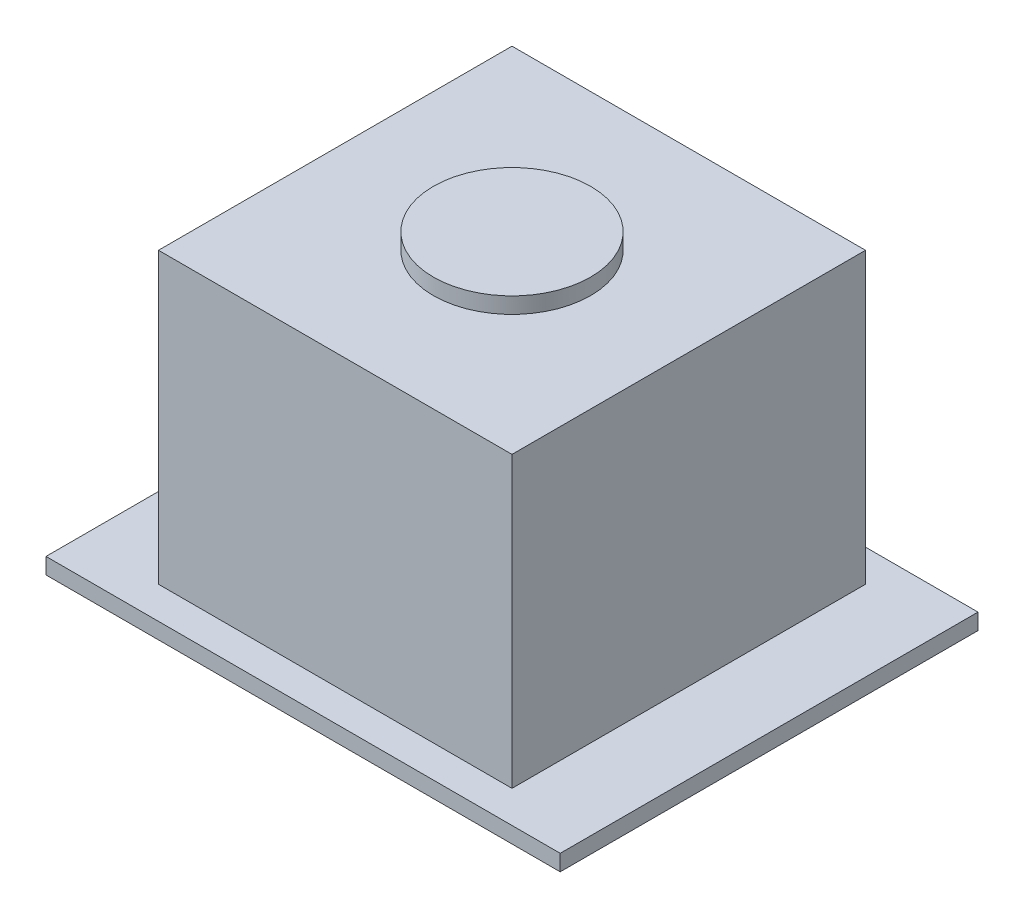
ISO-10303-21;
HEADER;
FILE_DESCRIPTION(('STEP AP214'),'2;1');
FILE_NAME('part.step','',(''),(''),'','','');
FILE_SCHEMA(('AUTOMOTIVE_DESIGN { 1 0 10303 214 1 1 1 1 }'));
ENDSEC;
DATA;
#1=APPLICATION_CONTEXT('core data for automotive mechanical design processes');
#2=APPLICATION_PROTOCOL_DEFINITION('international standard','automotive_design',2000,#1);
#3=PRODUCT_CONTEXT('',#1,'mechanical');
#4=PRODUCT('Part','Part','',(#3));
#5=PRODUCT_RELATED_PRODUCT_CATEGORY('part','',(#4));
#6=PRODUCT_DEFINITION_FORMATION('','',#4);
#7=PRODUCT_DEFINITION_CONTEXT('part definition',#1,'design');
#8=PRODUCT_DEFINITION('design','',#6,#7);
#9=PRODUCT_DEFINITION_SHAPE('','',#8);
#10=(LENGTH_UNIT() NAMED_UNIT(*) SI_UNIT(.MILLI.,.METRE.));
#11=(NAMED_UNIT(*) PLANE_ANGLE_UNIT() SI_UNIT($,.RADIAN.));
#12=(NAMED_UNIT(*) SI_UNIT($,.STERADIAN.) SOLID_ANGLE_UNIT());
#13=UNCERTAINTY_MEASURE_WITH_UNIT(LENGTH_MEASURE(1.E-05),#10,'distance_accuracy_value','');
#14=(GEOMETRIC_REPRESENTATION_CONTEXT(3) GLOBAL_UNCERTAINTY_ASSIGNED_CONTEXT((#13)) GLOBAL_UNIT_ASSIGNED_CONTEXT((#10,
#11,#12)) REPRESENTATION_CONTEXT('',''));
#15=CARTESIAN_POINT('',(0.,0.,0.));
#16=DIRECTION('',(0.,0.,1.));
#17=DIRECTION('',(1.,0.,0.));
#18=AXIS2_PLACEMENT_3D('',#15,#16,#17);
#19=CARTESIAN_POINT('',(132.976530612245,9.,96.6260204081633));
#20=DIRECTION('',(1.,0.,0.));
#21=DIRECTION('',(0.,0.,-1.));
#22=AXIS2_PLACEMENT_3D('',#19,#20,#21);
#23=PLANE('',#22);
#24=DIRECTION('',(0.,0.,1.));
#25=VECTOR('',#24,1.);
#26=CARTESIAN_POINT('',(132.976530612245,0.,96.6260204081633));
#27=LINE('',#26,#25);
#28=CARTESIAN_POINT('',(132.976530612245,0.,96.6260204081633));
#29=VERTEX_POINT('',#28);
#30=CARTESIAN_POINT('',(132.976530612245,0.,107.626020408163));
#31=VERTEX_POINT('',#30);
#32=EDGE_CURVE('E135',#29,#31,#27,.T.);
#33=ORIENTED_EDGE('',*,*,#32,.T.);
#34=DIRECTION('',(0.,-1.,0.));
#35=VECTOR('',#34,1.);
#36=CARTESIAN_POINT('',(132.976530612245,9.,107.626020408163));
#37=LINE('',#36,#35);
#38=CARTESIAN_POINT('',(132.976530612245,9.,107.626020408163));
#39=VERTEX_POINT('',#38);
#40=EDGE_CURVE('E48',#39,#31,#37,.T.);
#41=ORIENTED_EDGE('',*,*,#40,.F.);
#42=DIRECTION('',(0.,0.,1.));
#43=VECTOR('',#42,1.);
#44=CARTESIAN_POINT('',(132.976530612245,9.,96.6260204081633));
#45=LINE('',#44,#43);
#46=CARTESIAN_POINT('',(132.976530612245,9.,96.6260204081633));
#47=VERTEX_POINT('',#46);
#48=EDGE_CURVE('E146',#47,#39,#45,.T.);
#49=ORIENTED_EDGE('',*,*,#48,.F.);
#50=DIRECTION('',(0.,-1.,0.));
#51=VECTOR('',#50,1.);
#52=CARTESIAN_POINT('',(132.976530612245,9.,96.6260204081633));
#53=LINE('',#52,#51);
#54=EDGE_CURVE('E157',#47,#29,#53,.T.);
#55=ORIENTED_EDGE('',*,*,#54,.T.);
#56=EDGE_LOOP('',(#33,#41,#49,#55));
#57=FACE_BOUND('',#56,.T.);
#58=ADVANCED_FACE('F45',(#57),#23,.F.);
#59=CARTESIAN_POINT('',(132.976530612245,9.,107.626020408163));
#60=DIRECTION('',(0.,0.,-1.));
#61=DIRECTION('',(-1.,0.,0.));
#62=AXIS2_PLACEMENT_3D('',#59,#60,#61);
#63=PLANE('',#62);
#64=DIRECTION('',(1.,0.,0.));
#65=VECTOR('',#64,1.);
#66=CARTESIAN_POINT('',(132.976530612245,0.,107.626020408163));
#67=LINE('',#66,#65);
#68=CARTESIAN_POINT('',(143.976530612245,0.,107.626020408163));
#69=VERTEX_POINT('',#68);
#70=EDGE_CURVE('E140',#31,#69,#67,.T.);
#71=ORIENTED_EDGE('',*,*,#70,.T.);
#72=DIRECTION('',(0.,-1.,0.));
#73=VECTOR('',#72,1.);
#74=CARTESIAN_POINT('',(143.976530612245,9.,107.626020408163));
#75=LINE('',#74,#73);
#76=CARTESIAN_POINT('',(143.976530612245,9.,107.626020408163));
#77=VERTEX_POINT('',#76);
#78=EDGE_CURVE('E175',#77,#69,#75,.T.);
#79=ORIENTED_EDGE('',*,*,#78,.F.);
#80=DIRECTION('',(1.,0.,0.));
#81=VECTOR('',#80,1.);
#82=CARTESIAN_POINT('',(132.976530612245,9.,107.626020408163));
#83=LINE('',#82,#81);
#84=EDGE_CURVE('E149',#39,#77,#83,.T.);
#85=ORIENTED_EDGE('',*,*,#84,.F.);
#86=ORIENTED_EDGE('',*,*,#40,.T.);
#87=EDGE_LOOP('',(#71,#79,#85,#86));
#88=FACE_BOUND('',#87,.T.);
#89=ADVANCED_FACE('F185',(#88),#63,.F.);
#90=CARTESIAN_POINT('',(143.976530612245,9.,96.6260204081633));
#91=DIRECTION('',(-1.,0.,0.));
#92=DIRECTION('',(0.,0.,1.));
#93=AXIS2_PLACEMENT_3D('',#90,#91,#92);
#94=PLANE('',#93);
#95=DIRECTION('',(0.,0.,-1.));
#96=VECTOR('',#95,1.);
#97=CARTESIAN_POINT('',(143.976530612245,0.,96.6260204081633));
#98=LINE('',#97,#96);
#99=CARTESIAN_POINT('',(143.976530612245,0.,96.6260204081633));
#100=VERTEX_POINT('',#99);
#101=EDGE_CURVE('E162',#69,#100,#98,.T.);
#102=ORIENTED_EDGE('',*,*,#101,.T.);
#103=DIRECTION('',(0.,-1.,0.));
#104=VECTOR('',#103,1.);
#105=CARTESIAN_POINT('',(143.976530612245,9.,96.6260204081633));
#106=LINE('',#105,#104);
#107=CARTESIAN_POINT('',(143.976530612245,9.,96.6260204081633));
#108=VERTEX_POINT('',#107);
#109=EDGE_CURVE('E172',#108,#100,#106,.T.);
#110=ORIENTED_EDGE('',*,*,#109,.F.);
#111=DIRECTION('',(0.,0.,-1.));
#112=VECTOR('',#111,1.);
#113=CARTESIAN_POINT('',(143.976530612245,9.,96.6260204081633));
#114=LINE('',#113,#112);
#115=EDGE_CURVE('E153',#77,#108,#114,.T.);
#116=ORIENTED_EDGE('',*,*,#115,.F.);
#117=ORIENTED_EDGE('',*,*,#78,.T.);
#118=EDGE_LOOP('',(#102,#110,#116,#117));
#119=FACE_BOUND('',#118,.T.);
#120=ADVANCED_FACE('F195',(#119),#94,.F.);
#121=CARTESIAN_POINT('',(132.976530612245,9.,96.6260204081633));
#122=DIRECTION('',(0.,0.,1.));
#123=DIRECTION('',(1.,0.,0.));
#124=AXIS2_PLACEMENT_3D('',#121,#122,#123);
#125=PLANE('',#124);
#126=DIRECTION('',(-1.,0.,0.));
#127=VECTOR('',#126,1.);
#128=CARTESIAN_POINT('',(132.976530612245,0.,96.6260204081633));
#129=LINE('',#128,#127);
#130=EDGE_CURVE('E150',#100,#29,#129,.T.);
#131=ORIENTED_EDGE('',*,*,#130,.T.);
#132=ORIENTED_EDGE('',*,*,#54,.F.);
#133=DIRECTION('',(-1.,0.,0.));
#134=VECTOR('',#133,1.);
#135=CARTESIAN_POINT('',(132.976530612245,9.,96.6260204081633));
#136=LINE('',#135,#134);
#137=EDGE_CURVE('E62',#108,#47,#136,.T.);
#138=ORIENTED_EDGE('',*,*,#137,.F.);
#139=ORIENTED_EDGE('',*,*,#109,.T.);
#140=EDGE_LOOP('',(#131,#132,#138,#139));
#141=FACE_BOUND('',#140,.T.);
#142=ADVANCED_FACE('F193',(#141),#125,.F.);
#143=CARTESIAN_POINT('',(0.,9.,0.));
#144=DIRECTION('',(0.,1.,0.));
#145=DIRECTION('',(0.,0.,1.));
#146=AXIS2_PLACEMENT_3D('',#143,#144,#145);
#147=PLANE('',#146);
#148=CARTESIAN_POINT('',(138.476530612245,9.,102.126020408163));
#149=DIRECTION('',(0.,1.,0.));
#150=DIRECTION('',(0.,0.,1.));
#151=AXIS2_PLACEMENT_3D('',#148,#149,#150);
#152=CIRCLE('',#151,2.44658702742082);
#153=CARTESIAN_POINT('',(138.476530612245,9.,104.572607435584));
#154=VERTEX_POINT('',#153);
#155=EDGE_CURVE('E11',#154,#154,#152,.T.);
#156=ORIENTED_EDGE('',*,*,#155,.F.);
#157=EDGE_LOOP('',(#156));
#158=FACE_BOUND('',#157,.T.);
#159=ORIENTED_EDGE('',*,*,#48,.T.);
#160=ORIENTED_EDGE('',*,*,#84,.T.);
#161=ORIENTED_EDGE('',*,*,#115,.T.);
#162=ORIENTED_EDGE('',*,*,#137,.T.);
#163=EDGE_LOOP('',(#159,#160,#161,#162));
#164=FACE_BOUND('',#163,.T.);
#165=ADVANCED_FACE('F196',(#158,#164),#147,.T.);
#166=CARTESIAN_POINT('',(130.476530612245,-0.5,108.626020408163));
#167=DIRECTION('',(1.,0.,0.));
#168=DIRECTION('',(0.,0.,-1.));
#169=AXIS2_PLACEMENT_3D('',#166,#167,#168);
#170=PLANE('',#169);
#171=DIRECTION('',(0.,0.,-1.));
#172=VECTOR('',#171,1.);
#173=CARTESIAN_POINT('',(130.476530612245,0.,108.626020408163));
#174=LINE('',#173,#172);
#175=CARTESIAN_POINT('',(130.476530612245,0.,108.626020408163));
#176=VERTEX_POINT('',#175);
#177=CARTESIAN_POINT('',(130.476530612245,0.,95.6260204081633));
#178=VERTEX_POINT('',#177);
#179=EDGE_CURVE('E133',#176,#178,#174,.T.);
#180=ORIENTED_EDGE('',*,*,#179,.T.);
#181=DIRECTION('',(0.,1.,0.));
#182=VECTOR('',#181,1.);
#183=CARTESIAN_POINT('',(130.476530612245,-0.5,95.6260204081633));
#184=LINE('',#183,#182);
#185=CARTESIAN_POINT('',(130.476530612245,-0.5,95.6260204081633));
#186=VERTEX_POINT('',#185);
#187=EDGE_CURVE('E111',#186,#178,#184,.T.);
#188=ORIENTED_EDGE('',*,*,#187,.F.);
#189=DIRECTION('',(0.,0.,-1.));
#190=VECTOR('',#189,1.);
#191=CARTESIAN_POINT('',(130.476530612245,-0.5,108.626020408163));
#192=LINE('',#191,#190);
#193=CARTESIAN_POINT('',(130.476530612245,-0.5,108.626020408163));
#194=VERTEX_POINT('',#193);
#195=EDGE_CURVE('E119',#194,#186,#192,.T.);
#196=ORIENTED_EDGE('',*,*,#195,.F.);
#197=DIRECTION('',(0.,1.,0.));
#198=VECTOR('',#197,1.);
#199=CARTESIAN_POINT('',(130.476530612245,-0.5,108.626020408163));
#200=LINE('',#199,#198);
#201=EDGE_CURVE('E302',#194,#176,#200,.T.);
#202=ORIENTED_EDGE('',*,*,#201,.T.);
#203=EDGE_LOOP('',(#180,#188,#196,#202));
#204=FACE_BOUND('',#203,.T.);
#205=ADVANCED_FACE('F131',(#204),#170,.F.);
#206=CARTESIAN_POINT('',(130.476530612245,-0.5,95.6260204081633));
#207=DIRECTION('',(0.,0.,1.));
#208=DIRECTION('',(1.,0.,0.));
#209=AXIS2_PLACEMENT_3D('',#206,#207,#208);
#210=PLANE('',#209);
#211=DIRECTION('',(1.,0.,0.));
#212=VECTOR('',#211,1.);
#213=CARTESIAN_POINT('',(130.476530612245,0.,95.6260204081633));
#214=LINE('',#213,#212);
#215=CARTESIAN_POINT('',(146.476530612245,0.,95.6260204081633));
#216=VERTEX_POINT('',#215);
#217=EDGE_CURVE('E296',#178,#216,#214,.T.);
#218=ORIENTED_EDGE('',*,*,#217,.T.);
#219=DIRECTION('',(0.,1.,0.));
#220=VECTOR('',#219,1.);
#221=CARTESIAN_POINT('',(146.476530612245,-0.5,95.6260204081633));
#222=LINE('',#221,#220);
#223=CARTESIAN_POINT('',(146.476530612245,-0.5,95.6260204081633));
#224=VERTEX_POINT('',#223);
#225=EDGE_CURVE('E114',#224,#216,#222,.T.);
#226=ORIENTED_EDGE('',*,*,#225,.F.);
#227=DIRECTION('',(1.,0.,0.));
#228=VECTOR('',#227,1.);
#229=CARTESIAN_POINT('',(130.476530612245,-0.5,95.6260204081633));
#230=LINE('',#229,#228);
#231=EDGE_CURVE('E107',#186,#224,#230,.T.);
#232=ORIENTED_EDGE('',*,*,#231,.F.);
#233=ORIENTED_EDGE('',*,*,#187,.T.);
#234=EDGE_LOOP('',(#218,#226,#232,#233));
#235=FACE_BOUND('',#234,.T.);
#236=ADVANCED_FACE('F109',(#235),#210,.F.);
#237=CARTESIAN_POINT('',(146.476530612245,-0.5,108.626020408163));
#238=DIRECTION('',(-1.,0.,0.));
#239=DIRECTION('',(0.,0.,1.));
#240=AXIS2_PLACEMENT_3D('',#237,#238,#239);
#241=PLANE('',#240);
#242=DIRECTION('',(0.,0.,1.));
#243=VECTOR('',#242,1.);
#244=CARTESIAN_POINT('',(146.476530612245,0.,108.626020408163));
#245=LINE('',#244,#243);
#246=CARTESIAN_POINT('',(146.476530612245,0.,108.626020408163));
#247=VERTEX_POINT('',#246);
#248=EDGE_CURVE('E306',#216,#247,#245,.T.);
#249=ORIENTED_EDGE('',*,*,#248,.T.);
#250=DIRECTION('',(0.,1.,0.));
#251=VECTOR('',#250,1.);
#252=CARTESIAN_POINT('',(146.476530612245,-0.5,108.626020408163));
#253=LINE('',#252,#251);
#254=CARTESIAN_POINT('',(146.476530612245,-0.5,108.626020408163));
#255=VERTEX_POINT('',#254);
#256=EDGE_CURVE('E142',#255,#247,#253,.T.);
#257=ORIENTED_EDGE('',*,*,#256,.F.);
#258=DIRECTION('',(0.,0.,1.));
#259=VECTOR('',#258,1.);
#260=CARTESIAN_POINT('',(146.476530612245,-0.5,108.626020408163));
#261=LINE('',#260,#259);
#262=EDGE_CURVE('E118',#224,#255,#261,.T.);
#263=ORIENTED_EDGE('',*,*,#262,.F.);
#264=ORIENTED_EDGE('',*,*,#225,.T.);
#265=EDGE_LOOP('',(#249,#257,#263,#264));
#266=FACE_BOUND('',#265,.T.);
#267=ADVANCED_FACE('F236',(#266),#241,.F.);
#268=CARTESIAN_POINT('',(130.476530612245,-0.5,108.626020408163));
#269=DIRECTION('',(0.,0.,-1.));
#270=DIRECTION('',(-1.,0.,0.));
#271=AXIS2_PLACEMENT_3D('',#268,#269,#270);
#272=PLANE('',#271);
#273=DIRECTION('',(-1.,0.,0.));
#274=VECTOR('',#273,1.);
#275=CARTESIAN_POINT('',(130.476530612245,0.,108.626020408163));
#276=LINE('',#275,#274);
#277=EDGE_CURVE('E129',#247,#176,#276,.T.);
#278=ORIENTED_EDGE('',*,*,#277,.T.);
#279=ORIENTED_EDGE('',*,*,#201,.F.);
#280=DIRECTION('',(-1.,0.,0.));
#281=VECTOR('',#280,1.);
#282=CARTESIAN_POINT('',(130.476530612245,-0.5,108.626020408163));
#283=LINE('',#282,#281);
#284=EDGE_CURVE('E124',#255,#194,#283,.T.);
#285=ORIENTED_EDGE('',*,*,#284,.F.);
#286=ORIENTED_EDGE('',*,*,#256,.T.);
#287=EDGE_LOOP('',(#278,#279,#285,#286));
#288=FACE_BOUND('',#287,.T.);
#289=ADVANCED_FACE('F244',(#288),#272,.F.);
#290=CARTESIAN_POINT('',(0.,-0.5,0.));
#291=DIRECTION('',(0.,-1.,0.));
#292=DIRECTION('',(0.,0.,-1.));
#293=AXIS2_PLACEMENT_3D('',#290,#291,#292);
#294=PLANE('',#293);
#295=ORIENTED_EDGE('',*,*,#195,.T.);
#296=ORIENTED_EDGE('',*,*,#231,.T.);
#297=ORIENTED_EDGE('',*,*,#262,.T.);
#298=ORIENTED_EDGE('',*,*,#284,.T.);
#299=EDGE_LOOP('',(#295,#296,#297,#298));
#300=FACE_BOUND('',#299,.T.);
#301=ADVANCED_FACE('F122',(#300),#294,.T.);
#302=CARTESIAN_POINT('',(0.,0.,0.));
#303=DIRECTION('',(0.,-1.,0.));
#304=DIRECTION('',(0.,0.,-1.));
#305=AXIS2_PLACEMENT_3D('',#302,#303,#304);
#306=PLANE('',#305);
#307=ORIENTED_EDGE('',*,*,#32,.F.);
#308=ORIENTED_EDGE('',*,*,#130,.F.);
#309=ORIENTED_EDGE('',*,*,#101,.F.);
#310=ORIENTED_EDGE('',*,*,#70,.F.);
#311=EDGE_LOOP('',(#307,#308,#309,#310));
#312=FACE_BOUND('',#311,.T.);
#313=ORIENTED_EDGE('',*,*,#179,.F.);
#314=ORIENTED_EDGE('',*,*,#277,.F.);
#315=ORIENTED_EDGE('',*,*,#248,.F.);
#316=ORIENTED_EDGE('',*,*,#217,.F.);
#317=EDGE_LOOP('',(#313,#314,#315,#316));
#318=FACE_BOUND('',#317,.T.);
#319=ADVANCED_FACE('F189',(#312,#318),#306,.F.);
#320=CARTESIAN_POINT('',(138.476530612245,9.5,102.126020408163));
#321=DIRECTION('',(0.,-1.,0.));
#322=DIRECTION('',(0.,0.,-1.));
#323=AXIS2_PLACEMENT_3D('',#320,#321,#322);
#324=CYLINDRICAL_SURFACE('',#323,2.44658702742082);
#325=CARTESIAN_POINT('',(138.476530612245,9.5,102.126020408163));
#326=DIRECTION('',(0.,1.,0.));
#327=DIRECTION('',(0.,0.,1.));
#328=AXIS2_PLACEMENT_3D('',#325,#326,#327);
#329=CIRCLE('',#328,2.44658702742082);
#330=CARTESIAN_POINT('',(138.476530612245,9.5,104.572607435584));
#331=VERTEX_POINT('',#330);
#332=EDGE_CURVE('E292',#331,#331,#329,.T.);
#333=ORIENTED_EDGE('',*,*,#332,.F.);
#334=EDGE_LOOP('',(#333));
#335=FACE_BOUND('',#334,.T.);
#336=ORIENTED_EDGE('',*,*,#155,.T.);
#337=EDGE_LOOP('',(#336));
#338=FACE_BOUND('',#337,.T.);
#339=ADVANCED_FACE('F266',(#335,#338),#324,.T.);
#340=CARTESIAN_POINT('',(138.476530612245,9.5,102.126020408163));
#341=DIRECTION('',(0.,1.,0.));
#342=DIRECTION('',(0.,0.,1.));
#343=AXIS2_PLACEMENT_3D('',#340,#341,#342);
#344=PLANE('',#343);
#345=ORIENTED_EDGE('',*,*,#332,.T.);
#346=EDGE_LOOP('',(#345));
#347=FACE_BOUND('',#346,.T.);
#348=ADVANCED_FACE('F277',(#347),#344,.T.);
#349=CLOSED_SHELL('',(#58,#89,#120,#142,#165,#205,#236,#267,#289,#301,#319,#339,#348));
#350=MANIFOLD_SOLID_BREP('B2',#349);
#351=ADVANCED_BREP_SHAPE_REPRESENTATION('',(#18,#350),#14);
#352=SHAPE_DEFINITION_REPRESENTATION(#9,#351);
ENDSEC;
END-ISO-10303-21;
